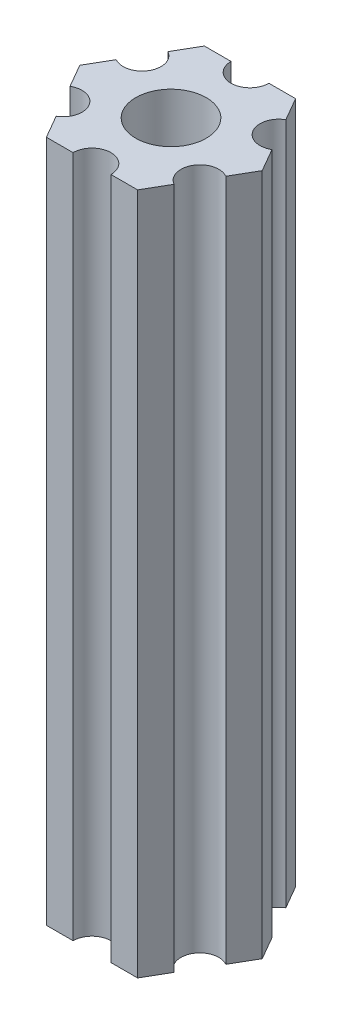
ISO-10303-21;
HEADER;
FILE_DESCRIPTION(('STEP AP214'),'2;1');
FILE_NAME('part.step','',(''),(''),'','','');
FILE_SCHEMA(('AUTOMOTIVE_DESIGN { 1 0 10303 214 1 1 1 1 }'));
ENDSEC;
DATA;
#1=APPLICATION_CONTEXT('core data for automotive mechanical design processes');
#2=APPLICATION_PROTOCOL_DEFINITION('international standard','automotive_design',2000,#1);
#3=PRODUCT_CONTEXT('',#1,'mechanical');
#4=PRODUCT('Part','Part','',(#3));
#5=PRODUCT_RELATED_PRODUCT_CATEGORY('part','',(#4));
#6=PRODUCT_DEFINITION_FORMATION('','',#4);
#7=PRODUCT_DEFINITION_CONTEXT('part definition',#1,'design');
#8=PRODUCT_DEFINITION('design','',#6,#7);
#9=PRODUCT_DEFINITION_SHAPE('','',#8);
#10=(LENGTH_UNIT() NAMED_UNIT(*) SI_UNIT(.MILLI.,.METRE.));
#11=(NAMED_UNIT(*) PLANE_ANGLE_UNIT() SI_UNIT($,.RADIAN.));
#12=(NAMED_UNIT(*) SI_UNIT($,.STERADIAN.) SOLID_ANGLE_UNIT());
#13=UNCERTAINTY_MEASURE_WITH_UNIT(LENGTH_MEASURE(1.E-05),#10,'distance_accuracy_value','');
#14=(GEOMETRIC_REPRESENTATION_CONTEXT(3) GLOBAL_UNCERTAINTY_ASSIGNED_CONTEXT((#13)) GLOBAL_UNIT_ASSIGNED_CONTEXT((#10,
#11,#12)) REPRESENTATION_CONTEXT('',''));
#15=CARTESIAN_POINT('',(0.,0.,0.));
#16=DIRECTION('',(0.,0.,1.));
#17=DIRECTION('',(1.,0.,0.));
#18=AXIS2_PLACEMENT_3D('',#15,#16,#17);
#19=CARTESIAN_POINT('',(5.41265877365274,31.,3.125));
#20=DIRECTION('',(0.,1.,0.));
#21=DIRECTION('',(0.,0.,1.));
#22=AXIS2_PLACEMENT_3D('',#19,#20,#21);
#23=CYLINDRICAL_SURFACE('',#22,1.5);
#24=CARTESIAN_POINT('',(5.41265877365274,85.,3.125));
#25=DIRECTION('',(0.,-1.,0.));
#26=DIRECTION('',(0.,0.,-1.));
#27=AXIS2_PLACEMENT_3D('',#24,#25,#26);
#28=CIRCLE('',#27,1.5);
#29=CARTESIAN_POINT('',(4.66265877365274,85.,4.42403810567666));
#30=VERTEX_POINT('',#29);
#31=CARTESIAN_POINT('',(6.16265877365274,85.,1.82596189432335));
#32=VERTEX_POINT('',#31);
#33=EDGE_CURVE('E190',#30,#32,#28,.T.);
#34=ORIENTED_EDGE('',*,*,#33,.F.);
#35=DIRECTION('',(0.,1.,0.));
#36=VECTOR('',#35,1.);
#37=CARTESIAN_POINT('',(4.66265877365274,31.,4.42403810567666));
#38=LINE('',#37,#36);
#39=CARTESIAN_POINT('',(4.66265877365274,31.,4.42403810567666));
#40=VERTEX_POINT('',#39);
#41=EDGE_CURVE('E11',#40,#30,#38,.T.);
#42=ORIENTED_EDGE('',*,*,#41,.F.);
#43=CARTESIAN_POINT('',(5.41265877365274,31.,3.125));
#44=DIRECTION('',(0.,-1.,0.));
#45=DIRECTION('',(0.,0.,-1.));
#46=AXIS2_PLACEMENT_3D('',#43,#44,#45);
#47=CIRCLE('',#46,1.5);
#48=CARTESIAN_POINT('',(6.16265877365274,31.,1.82596189432335));
#49=VERTEX_POINT('',#48);
#50=EDGE_CURVE('E241',#40,#49,#47,.T.);
#51=ORIENTED_EDGE('',*,*,#50,.T.);
#52=DIRECTION('',(0.,1.,0.));
#53=VECTOR('',#52,1.);
#54=CARTESIAN_POINT('',(6.16265877365274,31.,1.82596189432335));
#55=LINE('',#54,#53);
#56=EDGE_CURVE('E36',#49,#32,#55,.T.);
#57=ORIENTED_EDGE('',*,*,#56,.T.);
#58=EDGE_LOOP('',(#34,#42,#51,#57));
#59=FACE_BOUND('',#58,.T.);
#60=ADVANCED_FACE('F33',(#59),#23,.F.);
#61=CARTESIAN_POINT('',(3.60843918243516,31.,6.25));
#62=DIRECTION('',(0.866025403784439,0.,0.5));
#63=DIRECTION('',(0.5,0.,-0.866025403784439));
#64=AXIS2_PLACEMENT_3D('',#61,#62,#63);
#65=PLANE('',#64);
#66=DIRECTION('',(0.5,0.,-0.866025403784439));
#67=VECTOR('',#66,1.);
#68=CARTESIAN_POINT('',(3.60843918243516,85.,6.25));
#69=LINE('',#68,#67);
#70=CARTESIAN_POINT('',(3.60843918243516,85.,6.25));
#71=VERTEX_POINT('',#70);
#72=EDGE_CURVE('E239',#71,#30,#69,.T.);
#73=ORIENTED_EDGE('',*,*,#72,.F.);
#74=DIRECTION('',(0.,1.,0.));
#75=VECTOR('',#74,1.);
#76=CARTESIAN_POINT('',(3.60843918243516,31.,6.25));
#77=LINE('',#76,#75);
#78=CARTESIAN_POINT('',(3.60843918243516,31.,6.25));
#79=VERTEX_POINT('',#78);
#80=EDGE_CURVE('E42',#79,#71,#77,.T.);
#81=ORIENTED_EDGE('',*,*,#80,.F.);
#82=DIRECTION('',(0.5,0.,-0.866025403784439));
#83=VECTOR('',#82,1.);
#84=CARTESIAN_POINT('',(3.60843918243516,31.,6.25));
#85=LINE('',#84,#83);
#86=EDGE_CURVE('E180',#79,#40,#85,.T.);
#87=ORIENTED_EDGE('',*,*,#86,.T.);
#88=ORIENTED_EDGE('',*,*,#41,.T.);
#89=EDGE_LOOP('',(#73,#81,#87,#88));
#90=FACE_BOUND('',#89,.T.);
#91=ADVANCED_FACE('F273',(#90),#65,.T.);
#92=CARTESIAN_POINT('',(1.5,31.,6.25));
#93=DIRECTION('',(0.,0.,1.));
#94=DIRECTION('',(1.,0.,0.));
#95=AXIS2_PLACEMENT_3D('',#92,#93,#94);
#96=PLANE('',#95);
#97=DIRECTION('',(1.,0.,0.));
#98=VECTOR('',#97,1.);
#99=CARTESIAN_POINT('',(1.5,85.,6.25));
#100=LINE('',#99,#98);
#101=CARTESIAN_POINT('',(1.5,85.,6.25));
#102=VERTEX_POINT('',#101);
#103=EDGE_CURVE('E167',#102,#71,#100,.T.);
#104=ORIENTED_EDGE('',*,*,#103,.F.);
#105=DIRECTION('',(0.,1.,0.));
#106=VECTOR('',#105,1.);
#107=CARTESIAN_POINT('',(1.5,31.,6.25));
#108=LINE('',#107,#106);
#109=CARTESIAN_POINT('',(1.5,31.,6.25));
#110=VERTEX_POINT('',#109);
#111=EDGE_CURVE('E162',#110,#102,#108,.T.);
#112=ORIENTED_EDGE('',*,*,#111,.F.);
#113=DIRECTION('',(1.,0.,0.));
#114=VECTOR('',#113,1.);
#115=CARTESIAN_POINT('',(1.5,31.,6.25));
#116=LINE('',#115,#114);
#117=EDGE_CURVE('E165',#110,#79,#116,.T.);
#118=ORIENTED_EDGE('',*,*,#117,.T.);
#119=ORIENTED_EDGE('',*,*,#80,.T.);
#120=EDGE_LOOP('',(#104,#112,#118,#119));
#121=FACE_BOUND('',#120,.T.);
#122=ADVANCED_FACE('F164',(#121),#96,.T.);
#123=CARTESIAN_POINT('',(0.,31.,6.25));
#124=DIRECTION('',(0.,1.,0.));
#125=DIRECTION('',(0.,0.,1.));
#126=AXIS2_PLACEMENT_3D('',#123,#124,#125);
#127=CYLINDRICAL_SURFACE('',#126,1.5);
#128=CARTESIAN_POINT('',(0.,85.,6.25));
#129=DIRECTION('',(0.,-1.,0.));
#130=DIRECTION('',(0.,0.,-1.));
#131=AXIS2_PLACEMENT_3D('',#128,#129,#130);
#132=CIRCLE('',#131,1.5);
#133=CARTESIAN_POINT('',(-1.5,85.,6.25));
#134=VERTEX_POINT('',#133);
#135=EDGE_CURVE('E236',#134,#102,#132,.T.);
#136=ORIENTED_EDGE('',*,*,#135,.F.);
#137=DIRECTION('',(0.,1.,0.));
#138=VECTOR('',#137,1.);
#139=CARTESIAN_POINT('',(-1.5,31.,6.25));
#140=LINE('',#139,#138);
#141=CARTESIAN_POINT('',(-1.5,31.,6.25));
#142=VERTEX_POINT('',#141);
#143=EDGE_CURVE('E172',#142,#134,#140,.T.);
#144=ORIENTED_EDGE('',*,*,#143,.F.);
#145=CARTESIAN_POINT('',(0.,31.,6.25));
#146=DIRECTION('',(0.,-1.,0.));
#147=DIRECTION('',(0.,0.,-1.));
#148=AXIS2_PLACEMENT_3D('',#145,#146,#147);
#149=CIRCLE('',#148,1.5);
#150=EDGE_CURVE('E178',#142,#110,#149,.T.);
#151=ORIENTED_EDGE('',*,*,#150,.T.);
#152=ORIENTED_EDGE('',*,*,#111,.T.);
#153=EDGE_LOOP('',(#136,#144,#151,#152));
#154=FACE_BOUND('',#153,.T.);
#155=ADVANCED_FACE('F182',(#154),#127,.F.);
#156=CARTESIAN_POINT('',(-3.60843918243516,31.,6.25));
#157=DIRECTION('',(0.,0.,1.));
#158=DIRECTION('',(1.,0.,0.));
#159=AXIS2_PLACEMENT_3D('',#156,#157,#158);
#160=PLANE('',#159);
#161=DIRECTION('',(1.,0.,0.));
#162=VECTOR('',#161,1.);
#163=CARTESIAN_POINT('',(-3.60843918243516,85.,6.25));
#164=LINE('',#163,#162);
#165=CARTESIAN_POINT('',(-3.60843918243516,85.,6.25));
#166=VERTEX_POINT('',#165);
#167=EDGE_CURVE('E233',#166,#134,#164,.T.);
#168=ORIENTED_EDGE('',*,*,#167,.F.);
#169=DIRECTION('',(0.,1.,0.));
#170=VECTOR('',#169,1.);
#171=CARTESIAN_POINT('',(-3.60843918243516,31.,6.25));
#172=LINE('',#171,#170);
#173=CARTESIAN_POINT('',(-3.60843918243516,31.,6.25));
#174=VERTEX_POINT('',#173);
#175=EDGE_CURVE('E245',#174,#166,#172,.T.);
#176=ORIENTED_EDGE('',*,*,#175,.F.);
#177=DIRECTION('',(1.,0.,0.));
#178=VECTOR('',#177,1.);
#179=CARTESIAN_POINT('',(-3.60843918243516,31.,6.25));
#180=LINE('',#179,#178);
#181=EDGE_CURVE('E183',#174,#142,#180,.T.);
#182=ORIENTED_EDGE('',*,*,#181,.T.);
#183=ORIENTED_EDGE('',*,*,#143,.T.);
#184=EDGE_LOOP('',(#168,#176,#182,#183));
#185=FACE_BOUND('',#184,.T.);
#186=ADVANCED_FACE('F286',(#185),#160,.T.);
#187=CARTESIAN_POINT('',(-4.66265877365274,31.,4.42403810567666));
#188=DIRECTION('',(-0.866025403784439,0.,0.5));
#189=DIRECTION('',(0.5,0.,0.866025403784439));
#190=AXIS2_PLACEMENT_3D('',#187,#188,#189);
#191=PLANE('',#190);
#192=DIRECTION('',(0.5,0.,0.866025403784439));
#193=VECTOR('',#192,1.);
#194=CARTESIAN_POINT('',(-4.66265877365274,85.,4.42403810567666));
#195=LINE('',#194,#193);
#196=CARTESIAN_POINT('',(-4.66265877365274,85.,4.42403810567666));
#197=VERTEX_POINT('',#196);
#198=EDGE_CURVE('E230',#197,#166,#195,.T.);
#199=ORIENTED_EDGE('',*,*,#198,.F.);
#200=DIRECTION('',(0.,1.,0.));
#201=VECTOR('',#200,1.);
#202=CARTESIAN_POINT('',(-4.66265877365274,31.,4.42403810567666));
#203=LINE('',#202,#201);
#204=CARTESIAN_POINT('',(-4.66265877365274,31.,4.42403810567666));
#205=VERTEX_POINT('',#204);
#206=EDGE_CURVE('E247',#205,#197,#203,.T.);
#207=ORIENTED_EDGE('',*,*,#206,.F.);
#208=DIRECTION('',(0.5,0.,0.866025403784439));
#209=VECTOR('',#208,1.);
#210=CARTESIAN_POINT('',(-4.66265877365274,31.,4.42403810567666));
#211=LINE('',#210,#209);
#212=EDGE_CURVE('E185',#205,#174,#211,.T.);
#213=ORIENTED_EDGE('',*,*,#212,.T.);
#214=ORIENTED_EDGE('',*,*,#175,.T.);
#215=EDGE_LOOP('',(#199,#207,#213,#214));
#216=FACE_BOUND('',#215,.T.);
#217=ADVANCED_FACE('F289',(#216),#191,.T.);
#218=CARTESIAN_POINT('',(-5.41265877365274,31.,3.125));
#219=DIRECTION('',(0.,1.,0.));
#220=DIRECTION('',(0.,0.,1.));
#221=AXIS2_PLACEMENT_3D('',#218,#219,#220);
#222=CYLINDRICAL_SURFACE('',#221,1.5);
#223=CARTESIAN_POINT('',(-5.41265877365274,85.,3.125));
#224=DIRECTION('',(0.,-1.,0.));
#225=DIRECTION('',(0.,0.,-1.));
#226=AXIS2_PLACEMENT_3D('',#223,#224,#225);
#227=CIRCLE('',#226,1.5);
#228=CARTESIAN_POINT('',(-6.16265877365274,85.,1.82596189432335));
#229=VERTEX_POINT('',#228);
#230=EDGE_CURVE('E227',#229,#197,#227,.T.);
#231=ORIENTED_EDGE('',*,*,#230,.F.);
#232=DIRECTION('',(0.,1.,0.));
#233=VECTOR('',#232,1.);
#234=CARTESIAN_POINT('',(-6.16265877365274,31.,1.82596189432335));
#235=LINE('',#234,#233);
#236=CARTESIAN_POINT('',(-6.16265877365274,31.,1.82596189432335));
#237=VERTEX_POINT('',#236);
#238=EDGE_CURVE('E249',#237,#229,#235,.T.);
#239=ORIENTED_EDGE('',*,*,#238,.F.);
#240=CARTESIAN_POINT('',(-5.41265877365274,31.,3.125));
#241=DIRECTION('',(0.,-1.,0.));
#242=DIRECTION('',(0.,0.,-1.));
#243=AXIS2_PLACEMENT_3D('',#240,#241,#242);
#244=CIRCLE('',#243,1.5);
#245=EDGE_CURVE('E394',#237,#205,#244,.T.);
#246=ORIENTED_EDGE('',*,*,#245,.T.);
#247=ORIENTED_EDGE('',*,*,#206,.T.);
#248=EDGE_LOOP('',(#231,#239,#246,#247));
#249=FACE_BOUND('',#248,.T.);
#250=ADVANCED_FACE('F293',(#249),#222,.F.);
#251=CARTESIAN_POINT('',(-7.21687836487032,31.,0.));
#252=DIRECTION('',(-0.86602540378444,0.,0.499999999999998));
#253=DIRECTION('',(0.499999999999998,0.,0.86602540378444));
#254=AXIS2_PLACEMENT_3D('',#251,#252,#253);
#255=PLANE('',#254);
#256=DIRECTION('',(0.499999999999998,0.,0.86602540378444));
#257=VECTOR('',#256,1.);
#258=CARTESIAN_POINT('',(-7.21687836487032,85.,0.));
#259=LINE('',#258,#257);
#260=CARTESIAN_POINT('',(-7.21687836487032,85.,0.));
#261=VERTEX_POINT('',#260);
#262=EDGE_CURVE('E224',#261,#229,#259,.T.);
#263=ORIENTED_EDGE('',*,*,#262,.F.);
#264=DIRECTION('',(0.,1.,0.));
#265=VECTOR('',#264,1.);
#266=CARTESIAN_POINT('',(-7.21687836487032,31.,0.));
#267=LINE('',#266,#265);
#268=CARTESIAN_POINT('',(-7.21687836487032,31.,0.));
#269=VERTEX_POINT('',#268);
#270=EDGE_CURVE('E251',#269,#261,#267,.T.);
#271=ORIENTED_EDGE('',*,*,#270,.F.);
#272=DIRECTION('',(0.499999999999998,0.,0.86602540378444));
#273=VECTOR('',#272,1.);
#274=CARTESIAN_POINT('',(-7.21687836487032,31.,0.));
#275=LINE('',#274,#273);
#276=EDGE_CURVE('E391',#269,#237,#275,.T.);
#277=ORIENTED_EDGE('',*,*,#276,.T.);
#278=ORIENTED_EDGE('',*,*,#238,.T.);
#279=EDGE_LOOP('',(#263,#271,#277,#278));
#280=FACE_BOUND('',#279,.T.);
#281=ADVANCED_FACE('F297',(#280),#255,.T.);
#282=CARTESIAN_POINT('',(-6.16265877365274,31.,-1.82596189432334));
#283=DIRECTION('',(-0.866025403784438,0.,-0.5));
#284=DIRECTION('',(-0.5,0.,0.866025403784438));
#285=AXIS2_PLACEMENT_3D('',#282,#283,#284);
#286=PLANE('',#285);
#287=DIRECTION('',(-0.5,0.,0.866025403784438));
#288=VECTOR('',#287,1.);
#289=CARTESIAN_POINT('',(-6.16265877365274,85.,-1.82596189432334));
#290=LINE('',#289,#288);
#291=CARTESIAN_POINT('',(-6.16265877365274,85.,-1.82596189432334));
#292=VERTEX_POINT('',#291);
#293=EDGE_CURVE('E221',#292,#261,#290,.T.);
#294=ORIENTED_EDGE('',*,*,#293,.F.);
#295=DIRECTION('',(0.,1.,0.));
#296=VECTOR('',#295,1.);
#297=CARTESIAN_POINT('',(-6.16265877365274,31.,-1.82596189432334));
#298=LINE('',#297,#296);
#299=CARTESIAN_POINT('',(-6.16265877365274,31.,-1.82596189432334));
#300=VERTEX_POINT('',#299);
#301=EDGE_CURVE('E253',#300,#292,#298,.T.);
#302=ORIENTED_EDGE('',*,*,#301,.F.);
#303=DIRECTION('',(-0.5,0.,0.866025403784438));
#304=VECTOR('',#303,1.);
#305=CARTESIAN_POINT('',(-6.16265877365274,31.,-1.82596189432334));
#306=LINE('',#305,#304);
#307=EDGE_CURVE('E388',#300,#269,#306,.T.);
#308=ORIENTED_EDGE('',*,*,#307,.T.);
#309=ORIENTED_EDGE('',*,*,#270,.T.);
#310=EDGE_LOOP('',(#294,#302,#308,#309));
#311=FACE_BOUND('',#310,.T.);
#312=ADVANCED_FACE('F301',(#311),#286,.T.);
#313=CARTESIAN_POINT('',(-5.41265877365274,31.,-3.125));
#314=DIRECTION('',(0.,1.,0.));
#315=DIRECTION('',(0.,0.,1.));
#316=AXIS2_PLACEMENT_3D('',#313,#314,#315);
#317=CYLINDRICAL_SURFACE('',#316,1.5);
#318=CARTESIAN_POINT('',(-5.41265877365274,85.,-3.125));
#319=DIRECTION('',(0.,-1.,0.));
#320=DIRECTION('',(0.,0.,-1.));
#321=AXIS2_PLACEMENT_3D('',#318,#319,#320);
#322=CIRCLE('',#321,1.5);
#323=CARTESIAN_POINT('',(-4.66265877365274,85.,-4.42403810567666));
#324=VERTEX_POINT('',#323);
#325=EDGE_CURVE('E218',#324,#292,#322,.T.);
#326=ORIENTED_EDGE('',*,*,#325,.F.);
#327=DIRECTION('',(0.,1.,0.));
#328=VECTOR('',#327,1.);
#329=CARTESIAN_POINT('',(-4.66265877365274,31.,-4.42403810567666));
#330=LINE('',#329,#328);
#331=CARTESIAN_POINT('',(-4.66265877365274,31.,-4.42403810567666));
#332=VERTEX_POINT('',#331);
#333=EDGE_CURVE('E255',#332,#324,#330,.T.);
#334=ORIENTED_EDGE('',*,*,#333,.F.);
#335=CARTESIAN_POINT('',(-5.41265877365274,31.,-3.125));
#336=DIRECTION('',(0.,-1.,0.));
#337=DIRECTION('',(0.,0.,-1.));
#338=AXIS2_PLACEMENT_3D('',#335,#336,#337);
#339=CIRCLE('',#338,1.5);
#340=EDGE_CURVE('E385',#332,#300,#339,.T.);
#341=ORIENTED_EDGE('',*,*,#340,.T.);
#342=ORIENTED_EDGE('',*,*,#301,.T.);
#343=EDGE_LOOP('',(#326,#334,#341,#342));
#344=FACE_BOUND('',#343,.T.);
#345=ADVANCED_FACE('F305',(#344),#317,.F.);
#346=CARTESIAN_POINT('',(-3.60843918243516,31.,-6.25));
#347=DIRECTION('',(-0.866025403784439,0.,-0.5));
#348=DIRECTION('',(-0.5,0.,0.866025403784439));
#349=AXIS2_PLACEMENT_3D('',#346,#347,#348);
#350=PLANE('',#349);
#351=DIRECTION('',(-0.5,0.,0.866025403784439));
#352=VECTOR('',#351,1.);
#353=CARTESIAN_POINT('',(-3.60843918243516,85.,-6.25));
#354=LINE('',#353,#352);
#355=CARTESIAN_POINT('',(-3.60843918243516,85.,-6.25));
#356=VERTEX_POINT('',#355);
#357=EDGE_CURVE('E215',#356,#324,#354,.T.);
#358=ORIENTED_EDGE('',*,*,#357,.F.);
#359=DIRECTION('',(0.,1.,0.));
#360=VECTOR('',#359,1.);
#361=CARTESIAN_POINT('',(-3.60843918243516,31.,-6.25));
#362=LINE('',#361,#360);
#363=CARTESIAN_POINT('',(-3.60843918243516,31.,-6.25));
#364=VERTEX_POINT('',#363);
#365=EDGE_CURVE('E257',#364,#356,#362,.T.);
#366=ORIENTED_EDGE('',*,*,#365,.F.);
#367=DIRECTION('',(-0.5,0.,0.866025403784439));
#368=VECTOR('',#367,1.);
#369=CARTESIAN_POINT('',(-3.60843918243516,31.,-6.25));
#370=LINE('',#369,#368);
#371=EDGE_CURVE('E382',#364,#332,#370,.T.);
#372=ORIENTED_EDGE('',*,*,#371,.T.);
#373=ORIENTED_EDGE('',*,*,#333,.T.);
#374=EDGE_LOOP('',(#358,#366,#372,#373));
#375=FACE_BOUND('',#374,.T.);
#376=ADVANCED_FACE('F309',(#375),#350,.T.);
#377=CARTESIAN_POINT('',(-1.5,31.,-6.25));
#378=DIRECTION('',(0.,0.,-1.));
#379=DIRECTION('',(-1.,0.,0.));
#380=AXIS2_PLACEMENT_3D('',#377,#378,#379);
#381=PLANE('',#380);
#382=DIRECTION('',(-1.,0.,0.));
#383=VECTOR('',#382,1.);
#384=CARTESIAN_POINT('',(-1.5,85.,-6.25));
#385=LINE('',#384,#383);
#386=CARTESIAN_POINT('',(-1.5,85.,-6.25));
#387=VERTEX_POINT('',#386);
#388=EDGE_CURVE('E212',#387,#356,#385,.T.);
#389=ORIENTED_EDGE('',*,*,#388,.F.);
#390=DIRECTION('',(0.,1.,0.));
#391=VECTOR('',#390,1.);
#392=CARTESIAN_POINT('',(-1.5,31.,-6.25));
#393=LINE('',#392,#391);
#394=CARTESIAN_POINT('',(-1.5,31.,-6.25));
#395=VERTEX_POINT('',#394);
#396=EDGE_CURVE('E259',#395,#387,#393,.T.);
#397=ORIENTED_EDGE('',*,*,#396,.F.);
#398=DIRECTION('',(-1.,0.,0.));
#399=VECTOR('',#398,1.);
#400=CARTESIAN_POINT('',(-1.5,31.,-6.25));
#401=LINE('',#400,#399);
#402=EDGE_CURVE('E379',#395,#364,#401,.T.);
#403=ORIENTED_EDGE('',*,*,#402,.T.);
#404=ORIENTED_EDGE('',*,*,#365,.T.);
#405=EDGE_LOOP('',(#389,#397,#403,#404));
#406=FACE_BOUND('',#405,.T.);
#407=ADVANCED_FACE('F313',(#406),#381,.T.);
#408=CARTESIAN_POINT('',(0.,31.,-6.25));
#409=DIRECTION('',(0.,1.,0.));
#410=DIRECTION('',(0.,0.,1.));
#411=AXIS2_PLACEMENT_3D('',#408,#409,#410);
#412=CYLINDRICAL_SURFACE('',#411,1.5);
#413=CARTESIAN_POINT('',(0.,85.,-6.25));
#414=DIRECTION('',(0.,-1.,0.));
#415=DIRECTION('',(0.,0.,-1.));
#416=AXIS2_PLACEMENT_3D('',#413,#414,#415);
#417=CIRCLE('',#416,1.5);
#418=CARTESIAN_POINT('',(1.5,85.,-6.25));
#419=VERTEX_POINT('',#418);
#420=EDGE_CURVE('E209',#419,#387,#417,.T.);
#421=ORIENTED_EDGE('',*,*,#420,.F.);
#422=DIRECTION('',(0.,1.,0.));
#423=VECTOR('',#422,1.);
#424=CARTESIAN_POINT('',(1.5,31.,-6.25));
#425=LINE('',#424,#423);
#426=CARTESIAN_POINT('',(1.5,31.,-6.25));
#427=VERTEX_POINT('',#426);
#428=EDGE_CURVE('E261',#427,#419,#425,.T.);
#429=ORIENTED_EDGE('',*,*,#428,.F.);
#430=CARTESIAN_POINT('',(0.,31.,-6.25));
#431=DIRECTION('',(0.,-1.,0.));
#432=DIRECTION('',(0.,0.,-1.));
#433=AXIS2_PLACEMENT_3D('',#430,#431,#432);
#434=CIRCLE('',#433,1.5);
#435=EDGE_CURVE('E376',#427,#395,#434,.T.);
#436=ORIENTED_EDGE('',*,*,#435,.T.);
#437=ORIENTED_EDGE('',*,*,#396,.T.);
#438=EDGE_LOOP('',(#421,#429,#436,#437));
#439=FACE_BOUND('',#438,.T.);
#440=ADVANCED_FACE('F317',(#439),#412,.F.);
#441=CARTESIAN_POINT('',(3.60843918243516,31.,-6.25));
#442=DIRECTION('',(0.,0.,-1.));
#443=DIRECTION('',(-1.,0.,0.));
#444=AXIS2_PLACEMENT_3D('',#441,#442,#443);
#445=PLANE('',#444);
#446=DIRECTION('',(-1.,0.,0.));
#447=VECTOR('',#446,1.);
#448=CARTESIAN_POINT('',(3.60843918243516,85.,-6.25));
#449=LINE('',#448,#447);
#450=CARTESIAN_POINT('',(3.60843918243516,85.,-6.25));
#451=VERTEX_POINT('',#450);
#452=EDGE_CURVE('E206',#451,#419,#449,.T.);
#453=ORIENTED_EDGE('',*,*,#452,.F.);
#454=DIRECTION('',(0.,1.,0.));
#455=VECTOR('',#454,1.);
#456=CARTESIAN_POINT('',(3.60843918243516,31.,-6.25));
#457=LINE('',#456,#455);
#458=CARTESIAN_POINT('',(3.60843918243516,31.,-6.25));
#459=VERTEX_POINT('',#458);
#460=EDGE_CURVE('E263',#459,#451,#457,.T.);
#461=ORIENTED_EDGE('',*,*,#460,.F.);
#462=DIRECTION('',(-1.,0.,0.));
#463=VECTOR('',#462,1.);
#464=CARTESIAN_POINT('',(3.60843918243516,31.,-6.25));
#465=LINE('',#464,#463);
#466=EDGE_CURVE('E373',#459,#427,#465,.T.);
#467=ORIENTED_EDGE('',*,*,#466,.T.);
#468=ORIENTED_EDGE('',*,*,#428,.T.);
#469=EDGE_LOOP('',(#453,#461,#467,#468));
#470=FACE_BOUND('',#469,.T.);
#471=ADVANCED_FACE('F321',(#470),#445,.T.);
#472=CARTESIAN_POINT('',(4.66265877365274,31.,-4.42403810567666));
#473=DIRECTION('',(0.866025403784439,0.,-0.5));
#474=DIRECTION('',(-0.5,0.,-0.866025403784439));
#475=AXIS2_PLACEMENT_3D('',#472,#473,#474);
#476=PLANE('',#475);
#477=DIRECTION('',(-0.5,0.,-0.866025403784439));
#478=VECTOR('',#477,1.);
#479=CARTESIAN_POINT('',(4.66265877365274,85.,-4.42403810567666));
#480=LINE('',#479,#478);
#481=CARTESIAN_POINT('',(4.66265877365274,85.,-4.42403810567666));
#482=VERTEX_POINT('',#481);
#483=EDGE_CURVE('E203',#482,#451,#480,.T.);
#484=ORIENTED_EDGE('',*,*,#483,.F.);
#485=DIRECTION('',(0.,1.,0.));
#486=VECTOR('',#485,1.);
#487=CARTESIAN_POINT('',(4.66265877365274,31.,-4.42403810567666));
#488=LINE('',#487,#486);
#489=CARTESIAN_POINT('',(4.66265877365274,31.,-4.42403810567666));
#490=VERTEX_POINT('',#489);
#491=EDGE_CURVE('E265',#490,#482,#488,.T.);
#492=ORIENTED_EDGE('',*,*,#491,.F.);
#493=DIRECTION('',(-0.5,0.,-0.866025403784439));
#494=VECTOR('',#493,1.);
#495=CARTESIAN_POINT('',(4.66265877365274,31.,-4.42403810567666));
#496=LINE('',#495,#494);
#497=EDGE_CURVE('E370',#490,#459,#496,.T.);
#498=ORIENTED_EDGE('',*,*,#497,.T.);
#499=ORIENTED_EDGE('',*,*,#460,.T.);
#500=EDGE_LOOP('',(#484,#492,#498,#499));
#501=FACE_BOUND('',#500,.T.);
#502=ADVANCED_FACE('F325',(#501),#476,.T.);
#503=CARTESIAN_POINT('',(5.41265877365274,31.,-3.125));
#504=DIRECTION('',(0.,1.,0.));
#505=DIRECTION('',(0.,0.,1.));
#506=AXIS2_PLACEMENT_3D('',#503,#504,#505);
#507=CYLINDRICAL_SURFACE('',#506,1.5);
#508=CARTESIAN_POINT('',(5.41265877365274,85.,-3.125));
#509=DIRECTION('',(0.,-1.,0.));
#510=DIRECTION('',(0.,0.,-1.));
#511=AXIS2_PLACEMENT_3D('',#508,#509,#510);
#512=CIRCLE('',#511,1.5);
#513=CARTESIAN_POINT('',(6.16265877365274,85.,-1.82596189432334));
#514=VERTEX_POINT('',#513);
#515=EDGE_CURVE('E200',#514,#482,#512,.T.);
#516=ORIENTED_EDGE('',*,*,#515,.F.);
#517=DIRECTION('',(0.,1.,0.));
#518=VECTOR('',#517,1.);
#519=CARTESIAN_POINT('',(6.16265877365274,31.,-1.82596189432334));
#520=LINE('',#519,#518);
#521=CARTESIAN_POINT('',(6.16265877365274,31.,-1.82596189432334));
#522=VERTEX_POINT('',#521);
#523=EDGE_CURVE('E267',#522,#514,#520,.T.);
#524=ORIENTED_EDGE('',*,*,#523,.F.);
#525=CARTESIAN_POINT('',(5.41265877365274,31.,-3.125));
#526=DIRECTION('',(0.,-1.,0.));
#527=DIRECTION('',(0.,0.,-1.));
#528=AXIS2_PLACEMENT_3D('',#525,#526,#527);
#529=CIRCLE('',#528,1.5);
#530=EDGE_CURVE('E367',#522,#490,#529,.T.);
#531=ORIENTED_EDGE('',*,*,#530,.T.);
#532=ORIENTED_EDGE('',*,*,#491,.T.);
#533=EDGE_LOOP('',(#516,#524,#531,#532));
#534=FACE_BOUND('',#533,.T.);
#535=ADVANCED_FACE('F329',(#534),#507,.F.);
#536=CARTESIAN_POINT('',(7.21687836487032,31.,0.));
#537=DIRECTION('',(0.866025403784439,0.,-0.5));
#538=DIRECTION('',(-0.5,0.,-0.866025403784439));
#539=AXIS2_PLACEMENT_3D('',#536,#537,#538);
#540=PLANE('',#539);
#541=DIRECTION('',(-0.5,0.,-0.866025403784439));
#542=VECTOR('',#541,1.);
#543=CARTESIAN_POINT('',(7.21687836487032,85.,0.));
#544=LINE('',#543,#542);
#545=CARTESIAN_POINT('',(7.21687836487032,85.,0.));
#546=VERTEX_POINT('',#545);
#547=EDGE_CURVE('E197',#546,#514,#544,.T.);
#548=ORIENTED_EDGE('',*,*,#547,.F.);
#549=DIRECTION('',(0.,1.,0.));
#550=VECTOR('',#549,1.);
#551=CARTESIAN_POINT('',(7.21687836487032,31.,0.));
#552=LINE('',#551,#550);
#553=CARTESIAN_POINT('',(7.21687836487032,31.,0.));
#554=VERTEX_POINT('',#553);
#555=EDGE_CURVE('E268',#554,#546,#552,.T.);
#556=ORIENTED_EDGE('',*,*,#555,.F.);
#557=DIRECTION('',(-0.5,0.,-0.866025403784439));
#558=VECTOR('',#557,1.);
#559=CARTESIAN_POINT('',(7.21687836487032,31.,0.));
#560=LINE('',#559,#558);
#561=EDGE_CURVE('E364',#554,#522,#560,.T.);
#562=ORIENTED_EDGE('',*,*,#561,.T.);
#563=ORIENTED_EDGE('',*,*,#523,.T.);
#564=EDGE_LOOP('',(#548,#556,#562,#563));
#565=FACE_BOUND('',#564,.T.);
#566=ADVANCED_FACE('F333',(#565),#540,.T.);
#567=CARTESIAN_POINT('',(6.16265877365274,31.,1.82596189432335));
#568=DIRECTION('',(0.866025403784439,0.,0.499999999999999));
#569=DIRECTION('',(0.499999999999999,0.,-0.866025403784439));
#570=AXIS2_PLACEMENT_3D('',#567,#568,#569);
#571=PLANE('',#570);
#572=DIRECTION('',(0.499999999999999,0.,-0.86602540378444));
#573=VECTOR('',#572,1.);
#574=CARTESIAN_POINT('',(6.16265877365274,85.,1.82596189432335));
#575=LINE('',#574,#573);
#576=EDGE_CURVE('E193',#32,#546,#575,.T.);
#577=ORIENTED_EDGE('',*,*,#576,.F.);
#578=ORIENTED_EDGE('',*,*,#56,.F.);
#579=DIRECTION('',(0.499999999999999,0.,-0.86602540378444));
#580=VECTOR('',#579,1.);
#581=CARTESIAN_POINT('',(6.16265877365274,31.,1.82596189432335));
#582=LINE('',#581,#580);
#583=EDGE_CURVE('E362',#49,#554,#582,.T.);
#584=ORIENTED_EDGE('',*,*,#583,.T.);
#585=ORIENTED_EDGE('',*,*,#555,.T.);
#586=EDGE_LOOP('',(#577,#578,#584,#585));
#587=FACE_BOUND('',#586,.T.);
#588=ADVANCED_FACE('F270',(#587),#571,.T.);
#589=CARTESIAN_POINT('',(5.41265877365274,31.,3.125));
#590=DIRECTION('',(0.,-1.,0.));
#591=DIRECTION('',(0.,0.,-1.));
#592=AXIS2_PLACEMENT_3D('',#589,#590,#591);
#593=PLANE('',#592);
#594=CARTESIAN_POINT('',(0.,31.,0.));
#595=DIRECTION('',(0.,1.,0.));
#596=DIRECTION('',(0.,0.,-1.));
#597=AXIS2_PLACEMENT_3D('',#594,#595,#596);
#598=CIRCLE('',#597,2.79);
#599=CARTESIAN_POINT('',(0.,31.,-2.79));
#600=VERTEX_POINT('',#599);
#601=EDGE_CURVE('E194',#600,#600,#598,.T.);
#602=ORIENTED_EDGE('',*,*,#601,.T.);
#603=EDGE_LOOP('',(#602));
#604=FACE_BOUND('',#603,.T.);
#605=ORIENTED_EDGE('',*,*,#50,.F.);
#606=ORIENTED_EDGE('',*,*,#86,.F.);
#607=ORIENTED_EDGE('',*,*,#117,.F.);
#608=ORIENTED_EDGE('',*,*,#150,.F.);
#609=ORIENTED_EDGE('',*,*,#181,.F.);
#610=ORIENTED_EDGE('',*,*,#212,.F.);
#611=ORIENTED_EDGE('',*,*,#245,.F.);
#612=ORIENTED_EDGE('',*,*,#276,.F.);
#613=ORIENTED_EDGE('',*,*,#307,.F.);
#614=ORIENTED_EDGE('',*,*,#340,.F.);
#615=ORIENTED_EDGE('',*,*,#371,.F.);
#616=ORIENTED_EDGE('',*,*,#402,.F.);
#617=ORIENTED_EDGE('',*,*,#435,.F.);
#618=ORIENTED_EDGE('',*,*,#466,.F.);
#619=ORIENTED_EDGE('',*,*,#497,.F.);
#620=ORIENTED_EDGE('',*,*,#530,.F.);
#621=ORIENTED_EDGE('',*,*,#561,.F.);
#622=ORIENTED_EDGE('',*,*,#583,.F.);
#623=EDGE_LOOP('',(#605,#606,#607,#608,#609,#610,#611,#612,#613,#614,#615,#616,#617,#618,#619,
#620,#621,#622));
#624=FACE_BOUND('',#623,.T.);
#625=ADVANCED_FACE('F176',(#604,#624),#593,.T.);
#626=CARTESIAN_POINT('',(5.41265877365274,85.,3.125));
#627=DIRECTION('',(0.,-1.,0.));
#628=DIRECTION('',(0.,0.,-1.));
#629=AXIS2_PLACEMENT_3D('',#626,#627,#628);
#630=PLANE('',#629);
#631=CARTESIAN_POINT('',(0.,85.,0.));
#632=DIRECTION('',(0.,1.,0.));
#633=DIRECTION('',(0.,0.,-1.));
#634=AXIS2_PLACEMENT_3D('',#631,#632,#633);
#635=CIRCLE('',#634,2.79);
#636=CARTESIAN_POINT('',(0.,85.,-2.79));
#637=VERTEX_POINT('',#636);
#638=EDGE_CURVE('E357',#637,#637,#635,.T.);
#639=ORIENTED_EDGE('',*,*,#638,.F.);
#640=EDGE_LOOP('',(#639));
#641=FACE_BOUND('',#640,.T.);
#642=ORIENTED_EDGE('',*,*,#33,.T.);
#643=ORIENTED_EDGE('',*,*,#576,.T.);
#644=ORIENTED_EDGE('',*,*,#547,.T.);
#645=ORIENTED_EDGE('',*,*,#515,.T.);
#646=ORIENTED_EDGE('',*,*,#483,.T.);
#647=ORIENTED_EDGE('',*,*,#452,.T.);
#648=ORIENTED_EDGE('',*,*,#420,.T.);
#649=ORIENTED_EDGE('',*,*,#388,.T.);
#650=ORIENTED_EDGE('',*,*,#357,.T.);
#651=ORIENTED_EDGE('',*,*,#325,.T.);
#652=ORIENTED_EDGE('',*,*,#293,.T.);
#653=ORIENTED_EDGE('',*,*,#262,.T.);
#654=ORIENTED_EDGE('',*,*,#230,.T.);
#655=ORIENTED_EDGE('',*,*,#198,.T.);
#656=ORIENTED_EDGE('',*,*,#167,.T.);
#657=ORIENTED_EDGE('',*,*,#135,.T.);
#658=ORIENTED_EDGE('',*,*,#103,.T.);
#659=ORIENTED_EDGE('',*,*,#72,.T.);
#660=EDGE_LOOP('',(#642,#643,#644,#645,#646,#647,#648,#649,#650,#651,#652,#653,#654,#655,#656,
#657,#658,#659));
#661=FACE_BOUND('',#660,.T.);
#662=ADVANCED_FACE('F272',(#641,#661),#630,.F.);
#663=CARTESIAN_POINT('',(0.,31.,0.));
#664=DIRECTION('',(0.,1.,0.));
#665=DIRECTION('',(0.,0.,1.));
#666=AXIS2_PLACEMENT_3D('',#663,#664,#665);
#667=CYLINDRICAL_SURFACE('',#666,2.79);
#668=ORIENTED_EDGE('',*,*,#601,.F.);
#669=EDGE_LOOP('',(#668));
#670=FACE_BOUND('',#669,.T.);
#671=ORIENTED_EDGE('',*,*,#638,.T.);
#672=EDGE_LOOP('',(#671));
#673=FACE_BOUND('',#672,.T.);
#674=ADVANCED_FACE('F345',(#670,#673),#667,.F.);
#675=CLOSED_SHELL('',(#60,#91,#122,#155,#186,#217,#250,#281,#312,#345,#376,#407,#440,#471,#502,
#535,#566,#588,#625,#662,#674));
#676=MANIFOLD_SOLID_BREP('B2',#675);
#677=ADVANCED_BREP_SHAPE_REPRESENTATION('',(#18,#676),#14);
#678=SHAPE_DEFINITION_REPRESENTATION(#9,#677);
ENDSEC;
END-ISO-10303-21;
